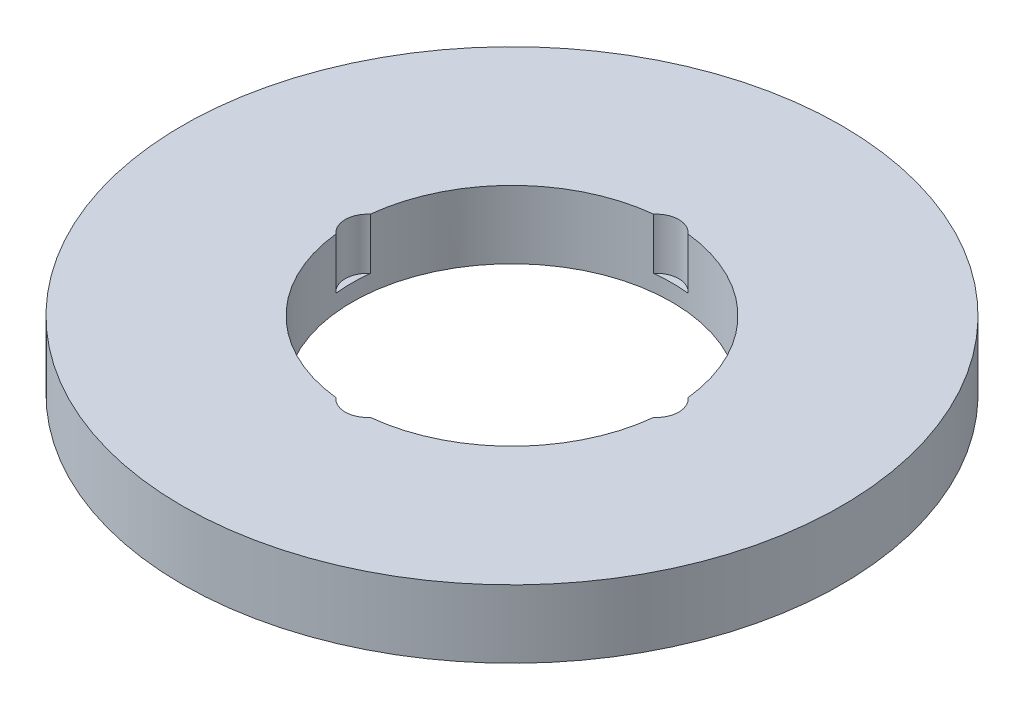
ISO-10303-21;
HEADER;
FILE_DESCRIPTION(('STEP AP214'),'2;1');
FILE_NAME('part.step','',(''),(''),'','','');
FILE_SCHEMA(('AUTOMOTIVE_DESIGN { 1 0 10303 214 1 1 1 1 }'));
ENDSEC;
DATA;
#1=APPLICATION_CONTEXT('core data for automotive mechanical design processes');
#2=APPLICATION_PROTOCOL_DEFINITION('international standard','automotive_design',2000,#1);
#3=PRODUCT_CONTEXT('',#1,'mechanical');
#4=PRODUCT('Part','Part','',(#3));
#5=PRODUCT_RELATED_PRODUCT_CATEGORY('part','',(#4));
#6=PRODUCT_DEFINITION_FORMATION('','',#4);
#7=PRODUCT_DEFINITION_CONTEXT('part definition',#1,'design');
#8=PRODUCT_DEFINITION('design','',#6,#7);
#9=PRODUCT_DEFINITION_SHAPE('','',#8);
#10=(LENGTH_UNIT() NAMED_UNIT(*) SI_UNIT(.MILLI.,.METRE.));
#11=(NAMED_UNIT(*) PLANE_ANGLE_UNIT() SI_UNIT($,.RADIAN.));
#12=(NAMED_UNIT(*) SI_UNIT($,.STERADIAN.) SOLID_ANGLE_UNIT());
#13=UNCERTAINTY_MEASURE_WITH_UNIT(LENGTH_MEASURE(1.E-05),#10,'distance_accuracy_value','');
#14=(GEOMETRIC_REPRESENTATION_CONTEXT(3) GLOBAL_UNCERTAINTY_ASSIGNED_CONTEXT((#13)) GLOBAL_UNIT_ASSIGNED_CONTEXT((#10,
#11,#12)) REPRESENTATION_CONTEXT('',''));
#15=CARTESIAN_POINT('',(0.,0.,0.));
#16=DIRECTION('',(0.,0.,1.));
#17=DIRECTION('',(1.,0.,0.));
#18=AXIS2_PLACEMENT_3D('',#15,#16,#17);
#19=CARTESIAN_POINT('',(0.,17.,0.));
#20=DIRECTION('',(0.,-1.,0.));
#21=DIRECTION('',(0.,0.,-1.));
#22=AXIS2_PLACEMENT_3D('',#19,#20,#21);
#23=CYLINDRICAL_SURFACE('',#22,82.5);
#24=CARTESIAN_POINT('',(0.,17.,0.));
#25=DIRECTION('',(0.,1.,0.));
#26=DIRECTION('',(0.,0.,1.));
#27=AXIS2_PLACEMENT_3D('',#24,#25,#26);
#28=CIRCLE('',#27,82.5);
#29=CARTESIAN_POINT('',(0.,17.,82.5));
#30=VERTEX_POINT('',#29);
#31=EDGE_CURVE('E148',#30,#30,#28,.T.);
#32=ORIENTED_EDGE('',*,*,#31,.F.);
#33=EDGE_LOOP('',(#32));
#34=FACE_BOUND('',#33,.T.);
#35=CARTESIAN_POINT('',(0.,0.,0.));
#36=DIRECTION('',(0.,1.,0.));
#37=DIRECTION('',(0.,0.,1.));
#38=AXIS2_PLACEMENT_3D('',#35,#36,#37);
#39=CIRCLE('',#38,82.5);
#40=CARTESIAN_POINT('',(0.,0.,82.5));
#41=VERTEX_POINT('',#40);
#42=EDGE_CURVE('E139',#41,#41,#39,.T.);
#43=ORIENTED_EDGE('',*,*,#42,.T.);
#44=EDGE_LOOP('',(#43));
#45=FACE_BOUND('',#44,.T.);
#46=ADVANCED_FACE('F39',(#34,#45),#23,.T.);
#47=CARTESIAN_POINT('',(0.,17.,0.));
#48=DIRECTION('',(0.,1.,0.));
#49=DIRECTION('',(0.,0.,1.));
#50=AXIS2_PLACEMENT_3D('',#47,#48,#49);
#51=PLANE('',#50);
#52=CARTESIAN_POINT('',(1.26036489604794E-13,17.,36.0982853331116));
#53=DIRECTION('',(0.,1.,0.));
#54=DIRECTION('',(1.,0.,0.));
#55=AXIS2_PLACEMENT_3D('',#52,#53,#54);
#56=CIRCLE('',#55,5.65249257641196);
#57=CARTESIAN_POINT('',(-4.29902297537346,17.,39.7683090092754));
#58=VERTEX_POINT('',#57);
#59=CARTESIAN_POINT('',(4.29902297537373,17.,39.7683090092753));
#60=VERTEX_POINT('',#59);
#61=EDGE_CURVE('E175',#58,#60,#56,.T.);
#62=ORIENTED_EDGE('',*,*,#61,.F.);
#63=CARTESIAN_POINT('',(0.,17.,0.));
#64=DIRECTION('',(0.,1.,0.));
#65=DIRECTION('',(0.,0.,1.));
#66=AXIS2_PLACEMENT_3D('',#63,#64,#65);
#67=CIRCLE('',#66,40.);
#68=CARTESIAN_POINT('',(-39.7683090092753,17.,4.2990229753736));
#69=VERTEX_POINT('',#68);
#70=EDGE_CURVE('E134',#69,#58,#67,.T.);
#71=ORIENTED_EDGE('',*,*,#70,.F.);
#72=CARTESIAN_POINT('',(-36.0982853331116,17.,0.));
#73=DIRECTION('',(0.,1.,0.));
#74=DIRECTION('',(0.,0.,1.));
#75=AXIS2_PLACEMENT_3D('',#72,#73,#74);
#76=CIRCLE('',#75,5.65249257641196);
#77=CARTESIAN_POINT('',(-39.7683090092753,17.,-4.2990229753736));
#78=VERTEX_POINT('',#77);
#79=EDGE_CURVE('E143',#78,#69,#76,.T.);
#80=ORIENTED_EDGE('',*,*,#79,.F.);
#81=CARTESIAN_POINT('',(-4.29902297537401,17.,-39.7683090092753));
#82=VERTEX_POINT('',#81);
#83=EDGE_CURVE('E123',#82,#78,#67,.T.);
#84=ORIENTED_EDGE('',*,*,#83,.F.);
#85=CARTESIAN_POINT('',(-3.78109468814382E-13,17.,-36.0982853331116));
#86=DIRECTION('',(0.,1.,0.));
#87=DIRECTION('',(-1.,0.,0.));
#88=AXIS2_PLACEMENT_3D('',#85,#86,#87);
#89=CIRCLE('',#88,5.65249257641196);
#90=CARTESIAN_POINT('',(4.29902297537318,17.,-39.7683090092754));
#91=VERTEX_POINT('',#90);
#92=EDGE_CURVE('E106',#91,#82,#89,.T.);
#93=ORIENTED_EDGE('',*,*,#92,.F.);
#94=CARTESIAN_POINT('',(39.7683090092753,17.,-4.2990229753736));
#95=VERTEX_POINT('',#94);
#96=EDGE_CURVE('E125',#95,#91,#67,.T.);
#97=ORIENTED_EDGE('',*,*,#96,.F.);
#98=CARTESIAN_POINT('',(36.0982853331116,17.,0.));
#99=DIRECTION('',(0.,1.,0.));
#100=DIRECTION('',(0.,0.,-1.));
#101=AXIS2_PLACEMENT_3D('',#98,#99,#100);
#102=CIRCLE('',#101,5.65249257641196);
#103=CARTESIAN_POINT('',(39.7683090092753,17.,4.2990229753736));
#104=VERTEX_POINT('',#103);
#105=EDGE_CURVE('E286',#104,#95,#102,.T.);
#106=ORIENTED_EDGE('',*,*,#105,.F.);
#107=EDGE_CURVE('E135',#60,#104,#67,.T.);
#108=ORIENTED_EDGE('',*,*,#107,.F.);
#109=EDGE_LOOP('',(#62,#71,#80,#84,#93,#97,#106,#108));
#110=FACE_BOUND('',#109,.T.);
#111=ORIENTED_EDGE('',*,*,#31,.T.);
#112=EDGE_LOOP('',(#111));
#113=FACE_BOUND('',#112,.T.);
#114=ADVANCED_FACE('F118',(#110,#113),#51,.T.);
#115=CARTESIAN_POINT('',(0.,0.,0.));
#116=DIRECTION('',(0.,1.,0.));
#117=DIRECTION('',(0.,0.,1.));
#118=AXIS2_PLACEMENT_3D('',#115,#116,#117);
#119=PLANE('',#118);
#120=CARTESIAN_POINT('',(0.,0.,0.));
#121=DIRECTION('',(0.,1.,0.));
#122=DIRECTION('',(0.,0.,1.));
#123=AXIS2_PLACEMENT_3D('',#120,#121,#122);
#124=CIRCLE('',#123,40.);
#125=CARTESIAN_POINT('',(0.,0.,40.));
#126=VERTEX_POINT('',#125);
#127=EDGE_CURVE('E136',#126,#126,#124,.T.);
#128=ORIENTED_EDGE('',*,*,#127,.T.);
#129=EDGE_LOOP('',(#128));
#130=FACE_BOUND('',#129,.T.);
#131=ORIENTED_EDGE('',*,*,#42,.F.);
#132=EDGE_LOOP('',(#131));
#133=FACE_BOUND('',#132,.T.);
#134=ADVANCED_FACE('F187',(#130,#133),#119,.F.);
#135=CARTESIAN_POINT('',(0.,17.,0.));
#136=DIRECTION('',(0.,-1.,0.));
#137=DIRECTION('',(0.,0.,-1.));
#138=AXIS2_PLACEMENT_3D('',#135,#136,#137);
#139=CYLINDRICAL_SURFACE('',#138,40.);
#140=DIRECTION('',(0.,1.,0.));
#141=VECTOR('',#140,1.);
#142=CARTESIAN_POINT('',(-4.29902297537345,10.5803777975365,39.7683090092754));
#143=LINE('',#142,#141);
#144=CARTESIAN_POINT('',(-4.29902297537346,4.16075559507295,39.7683090092754));
#145=VERTEX_POINT('',#144);
#146=EDGE_CURVE('E11',#145,#58,#143,.T.);
#147=ORIENTED_EDGE('',*,*,#146,.F.);
#148=CARTESIAN_POINT('',(0.,4.16075559507295,0.));
#149=DIRECTION('',(0.,1.,0.));
#150=DIRECTION('',(0.,0.,1.));
#151=AXIS2_PLACEMENT_3D('',#148,#149,#150);
#152=CIRCLE('',#151,40.);
#153=CARTESIAN_POINT('',(4.29902297537373,4.16075559507295,39.7683090092753));
#154=VERTEX_POINT('',#153);
#155=EDGE_CURVE('E170',#145,#154,#152,.T.);
#156=ORIENTED_EDGE('',*,*,#155,.T.);
#157=DIRECTION('',(0.,1.,0.));
#158=VECTOR('',#157,1.);
#159=CARTESIAN_POINT('',(4.29902297537372,10.5803777975365,39.7683090092753));
#160=LINE('',#159,#158);
#161=EDGE_CURVE('E46',#60,#154,#160,.F.);
#162=ORIENTED_EDGE('',*,*,#161,.F.);
#163=ORIENTED_EDGE('',*,*,#107,.T.);
#164=DIRECTION('',(0.,1.,0.));
#165=VECTOR('',#164,1.);
#166=CARTESIAN_POINT('',(39.7683090092753,10.5803777975365,4.29902297537359));
#167=LINE('',#166,#165);
#168=CARTESIAN_POINT('',(39.7683090092753,4.16075559507295,4.2990229753736));
#169=VERTEX_POINT('',#168);
#170=EDGE_CURVE('E164',#169,#104,#167,.T.);
#171=ORIENTED_EDGE('',*,*,#170,.F.);
#172=CARTESIAN_POINT('',(0.,4.16075559507295,0.));
#173=DIRECTION('',(0.,1.,0.));
#174=DIRECTION('',(0.,0.,1.));
#175=AXIS2_PLACEMENT_3D('',#172,#173,#174);
#176=CIRCLE('',#175,40.);
#177=CARTESIAN_POINT('',(39.7683090092753,4.16075559507295,-4.2990229753736));
#178=VERTEX_POINT('',#177);
#179=EDGE_CURVE('E115',#169,#178,#176,.T.);
#180=ORIENTED_EDGE('',*,*,#179,.T.);
#181=DIRECTION('',(0.,1.,0.));
#182=VECTOR('',#181,1.);
#183=CARTESIAN_POINT('',(39.7683090092753,10.5803777975365,-4.29902297537359));
#184=LINE('',#183,#182);
#185=EDGE_CURVE('E131',#95,#178,#184,.F.);
#186=ORIENTED_EDGE('',*,*,#185,.F.);
#187=ORIENTED_EDGE('',*,*,#96,.T.);
#188=DIRECTION('',(0.,1.,0.));
#189=VECTOR('',#188,1.);
#190=CARTESIAN_POINT('',(4.29902297537317,10.5803777975365,-39.7683090092754));
#191=LINE('',#190,#189);
#192=CARTESIAN_POINT('',(4.29902297537318,4.16075559507295,-39.7683090092754));
#193=VERTEX_POINT('',#192);
#194=EDGE_CURVE('E105',#193,#91,#191,.T.);
#195=ORIENTED_EDGE('',*,*,#194,.F.);
#196=CARTESIAN_POINT('',(0.,4.16075559507295,0.));
#197=DIRECTION('',(0.,1.,0.));
#198=DIRECTION('',(0.,0.,1.));
#199=AXIS2_PLACEMENT_3D('',#196,#197,#198);
#200=CIRCLE('',#199,40.);
#201=CARTESIAN_POINT('',(-4.29902297537401,4.16075559507295,-39.7683090092753));
#202=VERTEX_POINT('',#201);
#203=EDGE_CURVE('E159',#193,#202,#200,.T.);
#204=ORIENTED_EDGE('',*,*,#203,.T.);
#205=DIRECTION('',(0.,1.,0.));
#206=VECTOR('',#205,1.);
#207=CARTESIAN_POINT('',(-4.299022975374,10.5803777975365,-39.7683090092753));
#208=LINE('',#207,#206);
#209=EDGE_CURVE('E114',#82,#202,#208,.F.);
#210=ORIENTED_EDGE('',*,*,#209,.F.);
#211=ORIENTED_EDGE('',*,*,#83,.T.);
#212=DIRECTION('',(0.,1.,0.));
#213=VECTOR('',#212,1.);
#214=CARTESIAN_POINT('',(-39.7683090092753,10.5803777975365,-4.29902297537359));
#215=LINE('',#214,#213);
#216=CARTESIAN_POINT('',(-39.7683090092753,4.16075559507295,-4.2990229753736));
#217=VERTEX_POINT('',#216);
#218=EDGE_CURVE('E160',#217,#78,#215,.T.);
#219=ORIENTED_EDGE('',*,*,#218,.F.);
#220=CARTESIAN_POINT('',(0.,4.16075559507295,0.));
#221=DIRECTION('',(0.,1.,0.));
#222=DIRECTION('',(0.,0.,1.));
#223=AXIS2_PLACEMENT_3D('',#220,#221,#222);
#224=CIRCLE('',#223,40.);
#225=CARTESIAN_POINT('',(-39.7683090092753,4.16075559507295,4.2990229753736));
#226=VERTEX_POINT('',#225);
#227=EDGE_CURVE('E149',#217,#226,#224,.T.);
#228=ORIENTED_EDGE('',*,*,#227,.T.);
#229=DIRECTION('',(0.,1.,0.));
#230=VECTOR('',#229,1.);
#231=CARTESIAN_POINT('',(-39.7683090092753,10.5803777975365,4.29902297537359));
#232=LINE('',#231,#230);
#233=EDGE_CURVE('E152',#69,#226,#232,.F.);
#234=ORIENTED_EDGE('',*,*,#233,.F.);
#235=ORIENTED_EDGE('',*,*,#70,.T.);
#236=EDGE_LOOP('',(#147,#156,#162,#163,#171,#180,#186,#187,#195,#204,#210,#211,#219,#228,#234,#235));
#237=FACE_BOUND('',#236,.T.);
#238=ORIENTED_EDGE('',*,*,#127,.F.);
#239=EDGE_LOOP('',(#238));
#240=FACE_BOUND('',#239,.T.);
#241=ADVANCED_FACE('F126',(#237,#240),#139,.F.);
#242=CARTESIAN_POINT('',(-36.0982853331116,4.16075559507295,0.));
#243=DIRECTION('',(0.,1.,0.));
#244=DIRECTION('',(0.,0.,1.));
#245=AXIS2_PLACEMENT_3D('',#242,#243,#244);
#246=CYLINDRICAL_SURFACE('',#245,5.65249257641196);
#247=ORIENTED_EDGE('',*,*,#218,.T.);
#248=ORIENTED_EDGE('',*,*,#79,.T.);
#249=ORIENTED_EDGE('',*,*,#233,.T.);
#250=CARTESIAN_POINT('',(-36.0982853331116,4.16075559507295,0.));
#251=DIRECTION('',(0.,1.,0.));
#252=DIRECTION('',(0.,0.,1.));
#253=AXIS2_PLACEMENT_3D('',#250,#251,#252);
#254=CIRCLE('',#253,5.65249257641196);
#255=EDGE_CURVE('E144',#217,#226,#254,.T.);
#256=ORIENTED_EDGE('',*,*,#255,.F.);
#257=EDGE_LOOP('',(#247,#248,#249,#256));
#258=FACE_BOUND('',#257,.T.);
#259=ADVANCED_FACE('F200',(#258),#246,.F.);
#260=CARTESIAN_POINT('',(-36.0982853331116,4.16075559507295,0.));
#261=DIRECTION('',(0.,1.,0.));
#262=DIRECTION('',(0.,0.,1.));
#263=AXIS2_PLACEMENT_3D('',#260,#261,#262);
#264=PLANE('',#263);
#265=ORIENTED_EDGE('',*,*,#255,.T.);
#266=ORIENTED_EDGE('',*,*,#227,.F.);
#267=EDGE_LOOP('',(#265,#266));
#268=FACE_BOUND('',#267,.T.);
#269=ADVANCED_FACE('F201',(#268),#264,.T.);
#270=CARTESIAN_POINT('',(-3.78109468814382E-13,4.16075559507295,-36.0982853331116));
#271=DIRECTION('',(0.,1.,0.));
#272=DIRECTION('',(0.,0.,1.));
#273=AXIS2_PLACEMENT_3D('',#270,#271,#272);
#274=CYLINDRICAL_SURFACE('',#273,5.65249257641196);
#275=ORIENTED_EDGE('',*,*,#194,.T.);
#276=ORIENTED_EDGE('',*,*,#92,.T.);
#277=ORIENTED_EDGE('',*,*,#209,.T.);
#278=CARTESIAN_POINT('',(-3.78109468814382E-13,4.16075559507295,-36.0982853331116));
#279=DIRECTION('',(0.,1.,0.));
#280=DIRECTION('',(-1.,0.,0.));
#281=AXIS2_PLACEMENT_3D('',#278,#279,#280);
#282=CIRCLE('',#281,5.65249257641196);
#283=EDGE_CURVE('E107',#193,#202,#282,.T.);
#284=ORIENTED_EDGE('',*,*,#283,.F.);
#285=EDGE_LOOP('',(#275,#276,#277,#284));
#286=FACE_BOUND('',#285,.T.);
#287=ADVANCED_FACE('F102',(#286),#274,.F.);
#288=CARTESIAN_POINT('',(-3.78109468814382E-13,4.16075559507295,-36.0982853331116));
#289=DIRECTION('',(0.,1.,0.));
#290=DIRECTION('',(-1.,0.,0.));
#291=AXIS2_PLACEMENT_3D('',#288,#289,#290);
#292=PLANE('',#291);
#293=ORIENTED_EDGE('',*,*,#283,.T.);
#294=ORIENTED_EDGE('',*,*,#203,.F.);
#295=EDGE_LOOP('',(#293,#294));
#296=FACE_BOUND('',#295,.T.);
#297=ADVANCED_FACE('F209',(#296),#292,.T.);
#298=CARTESIAN_POINT('',(36.0982853331116,4.16075559507295,0.));
#299=DIRECTION('',(0.,1.,0.));
#300=DIRECTION('',(0.,0.,1.));
#301=AXIS2_PLACEMENT_3D('',#298,#299,#300);
#302=CYLINDRICAL_SURFACE('',#301,5.65249257641196);
#303=ORIENTED_EDGE('',*,*,#170,.T.);
#304=ORIENTED_EDGE('',*,*,#105,.T.);
#305=ORIENTED_EDGE('',*,*,#185,.T.);
#306=CARTESIAN_POINT('',(36.0982853331116,4.16075559507295,0.));
#307=DIRECTION('',(0.,1.,0.));
#308=DIRECTION('',(0.,0.,-1.));
#309=AXIS2_PLACEMENT_3D('',#306,#307,#308);
#310=CIRCLE('',#309,5.65249257641196);
#311=EDGE_CURVE('E56',#169,#178,#310,.T.);
#312=ORIENTED_EDGE('',*,*,#311,.F.);
#313=EDGE_LOOP('',(#303,#304,#305,#312));
#314=FACE_BOUND('',#313,.T.);
#315=ADVANCED_FACE('F213',(#314),#302,.F.);
#316=CARTESIAN_POINT('',(36.0982853331116,4.16075559507295,0.));
#317=DIRECTION('',(0.,1.,0.));
#318=DIRECTION('',(0.,0.,-1.));
#319=AXIS2_PLACEMENT_3D('',#316,#317,#318);
#320=PLANE('',#319);
#321=ORIENTED_EDGE('',*,*,#311,.T.);
#322=ORIENTED_EDGE('',*,*,#179,.F.);
#323=EDGE_LOOP('',(#321,#322));
#324=FACE_BOUND('',#323,.T.);
#325=ADVANCED_FACE('F179',(#324),#320,.T.);
#326=CARTESIAN_POINT('',(1.26036489604794E-13,4.16075559507295,36.0982853331116));
#327=DIRECTION('',(0.,1.,0.));
#328=DIRECTION('',(0.,0.,1.));
#329=AXIS2_PLACEMENT_3D('',#326,#327,#328);
#330=CYLINDRICAL_SURFACE('',#329,5.65249257641196);
#331=ORIENTED_EDGE('',*,*,#146,.T.);
#332=ORIENTED_EDGE('',*,*,#61,.T.);
#333=ORIENTED_EDGE('',*,*,#161,.T.);
#334=CARTESIAN_POINT('',(1.26036489604794E-13,4.16075559507295,36.0982853331116));
#335=DIRECTION('',(0.,1.,0.));
#336=DIRECTION('',(1.,0.,0.));
#337=AXIS2_PLACEMENT_3D('',#334,#335,#336);
#338=CIRCLE('',#337,5.65249257641196);
#339=EDGE_CURVE('E55',#145,#154,#338,.T.);
#340=ORIENTED_EDGE('',*,*,#339,.F.);
#341=EDGE_LOOP('',(#331,#332,#333,#340));
#342=FACE_BOUND('',#341,.T.);
#343=ADVANCED_FACE('F171',(#342),#330,.F.);
#344=CARTESIAN_POINT('',(1.26036489604794E-13,4.16075559507295,36.0982853331116));
#345=DIRECTION('',(0.,1.,0.));
#346=DIRECTION('',(1.,0.,0.));
#347=AXIS2_PLACEMENT_3D('',#344,#345,#346);
#348=PLANE('',#347);
#349=ORIENTED_EDGE('',*,*,#339,.T.);
#350=ORIENTED_EDGE('',*,*,#155,.F.);
#351=EDGE_LOOP('',(#349,#350));
#352=FACE_BOUND('',#351,.T.);
#353=ADVANCED_FACE('F173',(#352),#348,.T.);
#354=CLOSED_SHELL('',(#46,#114,#134,#241,#259,#269,#287,#297,#315,#325,#343,#353));
#355=MANIFOLD_SOLID_BREP('B2',#354);
#356=ADVANCED_BREP_SHAPE_REPRESENTATION('',(#18,#355),#14);
#357=SHAPE_DEFINITION_REPRESENTATION(#9,#356);
ENDSEC;
END-ISO-10303-21;
